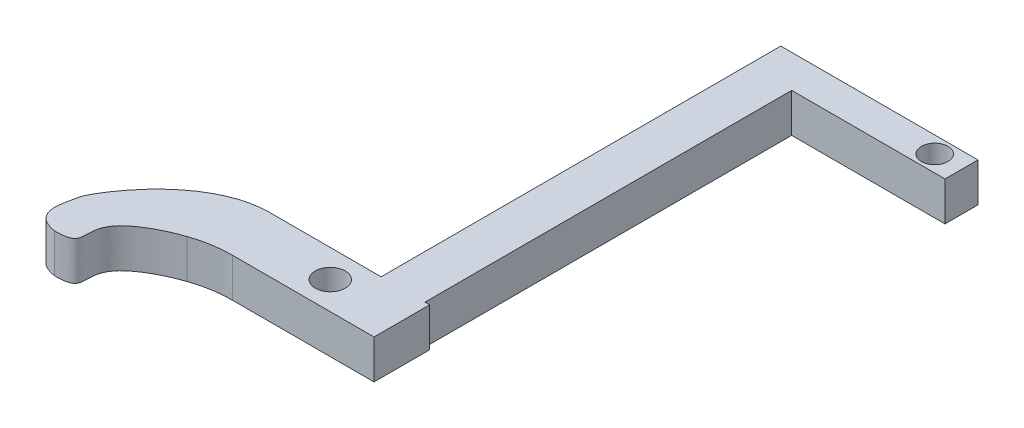
ISO-10303-21;
HEADER;
FILE_DESCRIPTION(('STEP AP214'),'2;1');
FILE_NAME('part.step','',(''),(''),'','','');
FILE_SCHEMA(('AUTOMOTIVE_DESIGN { 1 0 10303 214 1 1 1 1 }'));
ENDSEC;
DATA;
#1=APPLICATION_CONTEXT('core data for automotive mechanical design processes');
#2=APPLICATION_PROTOCOL_DEFINITION('international standard','automotive_design',2000,#1);
#3=PRODUCT_CONTEXT('',#1,'mechanical');
#4=PRODUCT('Part','Part','',(#3));
#5=PRODUCT_RELATED_PRODUCT_CATEGORY('part','',(#4));
#6=PRODUCT_DEFINITION_FORMATION('','',#4);
#7=PRODUCT_DEFINITION_CONTEXT('part definition',#1,'design');
#8=PRODUCT_DEFINITION('design','',#6,#7);
#9=PRODUCT_DEFINITION_SHAPE('','',#8);
#10=(LENGTH_UNIT() NAMED_UNIT(*) SI_UNIT(.MILLI.,.METRE.));
#11=(NAMED_UNIT(*) PLANE_ANGLE_UNIT() SI_UNIT($,.RADIAN.));
#12=(NAMED_UNIT(*) SI_UNIT($,.STERADIAN.) SOLID_ANGLE_UNIT());
#13=UNCERTAINTY_MEASURE_WITH_UNIT(LENGTH_MEASURE(1.E-05),#10,'distance_accuracy_value','');
#14=(GEOMETRIC_REPRESENTATION_CONTEXT(3) GLOBAL_UNCERTAINTY_ASSIGNED_CONTEXT((#13)) GLOBAL_UNIT_ASSIGNED_CONTEXT((#10,
#11,#12)) REPRESENTATION_CONTEXT('',''));
#15=CARTESIAN_POINT('',(0.,0.,0.));
#16=DIRECTION('',(0.,0.,1.));
#17=DIRECTION('',(1.,0.,0.));
#18=AXIS2_PLACEMENT_3D('',#15,#16,#17);
#19=CARTESIAN_POINT('',(9.39471263885483,3.9,-13.3426777583693));
#20=CARTESIAN_POINT('',(6.79427073100031,3.9,-13.7760847430118));
#21=CARTESIAN_POINT('',(7.42371497519791,3.9,-16.0946088556389));
#22=CARTESIAN_POINT('',(7.96105575206158,3.9,-18.6181851229023));
#23=CARTESIAN_POINT('',(13.166799439437,3.9,-25.974660634704));
#24=CARTESIAN_POINT('',(19.1234364955157,3.9,-25.7010819216978));
#25=B_SPLINE_CURVE_WITH_KNOTS('',3,(#19,#20,#21,#22,#23,#24),.UNSPECIFIED.,.F.,.F.,(4,1,1,4),
(0.,0.580649742311301,0.680649742311301,1.),.UNSPECIFIED.);
#26=DIRECTION('',(0.,-1.,0.));
#27=VECTOR('',#26,1.);
#28=SURFACE_OF_LINEAR_EXTRUSION('',#25,#27);
#29=CARTESIAN_POINT('',(9.39471263885482,3.9,-13.3426777583693));
#30=VERTEX_POINT('',#29);
#31=CARTESIAN_POINT('',(18.9793949508873,3.9,-25.7065689780499));
#32=VERTEX_POINT('',#31);
#33=EDGE_CURVE('E180',#30,#32,#25,.T.);
#34=ORIENTED_EDGE('',*,*,#33,.T.);
#35=DIRECTION('',(0.,-1.,0.));
#36=VECTOR('',#35,1.);
#37=CARTESIAN_POINT('',(18.9793949508873,3.9,-25.7065689780499));
#38=LINE('',#37,#36);
#39=CARTESIAN_POINT('',(18.9793949508873,0.,-25.7065689780499));
#40=VERTEX_POINT('',#39);
#41=EDGE_CURVE('E225',#32,#40,#38,.T.);
#42=ORIENTED_EDGE('',*,*,#41,.T.);
#43=CARTESIAN_POINT('',(9.39471263885483,0.,-13.3426777583693));
#44=CARTESIAN_POINT('',(6.79427073100031,0.,-13.7760847430118));
#45=CARTESIAN_POINT('',(7.42371497519791,0.,-16.0946088556389));
#46=CARTESIAN_POINT('',(7.96105575206158,0.,-18.6181851229023));
#47=CARTESIAN_POINT('',(13.166799439437,0.,-25.974660634704));
#48=CARTESIAN_POINT('',(19.1234364955157,0.,-25.7010819216978));
#49=B_SPLINE_CURVE_WITH_KNOTS('',3,(#43,#44,#45,#46,#47,#48),.UNSPECIFIED.,.F.,.F.,(4,1,1,4),
(0.,0.580649742311301,0.680649742311301,1.),.UNSPECIFIED.);
#50=CARTESIAN_POINT('',(9.39471263885482,0.,-13.3426777583693));
#51=VERTEX_POINT('',#50);
#52=EDGE_CURVE('E295',#51,#40,#49,.T.);
#53=ORIENTED_EDGE('',*,*,#52,.F.);
#54=DIRECTION('',(0.,-1.,0.));
#55=VECTOR('',#54,1.);
#56=CARTESIAN_POINT('',(9.39471263885482,3.9,-13.3426777583693));
#57=LINE('',#56,#55);
#58=EDGE_CURVE('E246',#30,#51,#57,.T.);
#59=ORIENTED_EDGE('',*,*,#58,.F.);
#60=EDGE_LOOP('',(#34,#42,#53,#59));
#61=FACE_BOUND('',#60,.T.);
#62=ADVANCED_FACE('F41',(#61),#28,.T.);
#63=CARTESIAN_POINT('',(19.1234364955155,3.9,-20.1323581347365));
#64=CARTESIAN_POINT('',(16.2160059305895,3.9,-19.6758710564032));
#65=CARTESIAN_POINT('',(8.71776321899043,3.9,-15.9481805674973));
#66=CARTESIAN_POINT('',(12.7758220810839,3.9,-13.309851453105));
#67=CARTESIAN_POINT('',(9.39471263885482,3.9,-13.3426777583693));
#68=B_SPLINE_CURVE_WITH_KNOTS('',3,(#63,#64,#65,#66,#67),.UNSPECIFIED.,.F.,.F.,(4,1,4),(0.,
0.368689926471484,1.),.UNSPECIFIED.);
#69=DIRECTION('',(0.,-1.,0.));
#70=VECTOR('',#69,1.);
#71=SURFACE_OF_LINEAR_EXTRUSION('',#68,#70);
#72=CARTESIAN_POINT('',(19.1234364955155,0.,-20.1323581347365));
#73=CARTESIAN_POINT('',(16.2160059305895,0.,-19.6758710564032));
#74=CARTESIAN_POINT('',(8.71776321899043,0.,-15.9481805674973));
#75=CARTESIAN_POINT('',(12.7758220810839,0.,-13.309851453105));
#76=CARTESIAN_POINT('',(9.39471263885482,0.,-13.3426777583693));
#77=B_SPLINE_CURVE_WITH_KNOTS('',3,(#72,#73,#74,#75,#76),.UNSPECIFIED.,.F.,.F.,(4,1,4),(0.,
0.368689926471484,1.),.UNSPECIFIED.);
#78=CARTESIAN_POINT('',(16.5474678199235,0.,-19.4901026125291));
#79=VERTEX_POINT('',#78);
#80=EDGE_CURVE('E290',#79,#51,#77,.T.);
#81=ORIENTED_EDGE('',*,*,#80,.F.);
#82=DIRECTION('',(0.,-1.,0.));
#83=VECTOR('',#82,1.);
#84=CARTESIAN_POINT('',(16.5474678199235,0.,-19.4901026125291));
#85=LINE('',#84,#83);
#86=CARTESIAN_POINT('',(16.5474678199235,3.9,-19.4901026125291));
#87=VERTEX_POINT('',#86);
#88=EDGE_CURVE('E233',#79,#87,#85,.F.);
#89=ORIENTED_EDGE('',*,*,#88,.T.);
#90=EDGE_CURVE('E188',#87,#30,#68,.T.);
#91=ORIENTED_EDGE('',*,*,#90,.T.);
#92=ORIENTED_EDGE('',*,*,#58,.T.);
#93=EDGE_LOOP('',(#81,#89,#91,#92));
#94=FACE_BOUND('',#93,.T.);
#95=ADVANCED_FACE('F200',(#94),#71,.T.);
#96=CARTESIAN_POINT('',(0.,3.9,-20.1323581347365));
#97=DIRECTION('',(0.,0.,-1.));
#98=DIRECTION('',(-1.,0.,0.));
#99=AXIS2_PLACEMENT_3D('',#96,#97,#98);
#100=PLANE('',#99);
#101=DIRECTION('',(1.,0.,0.));
#102=VECTOR('',#101,1.);
#103=CARTESIAN_POINT('',(0.,3.9,-20.1323581347365));
#104=LINE('',#103,#102);
#105=CARTESIAN_POINT('',(20.4206629321236,3.9,-20.1323581347365));
#106=VERTEX_POINT('',#105);
#107=CARTESIAN_POINT('',(34.5975482501285,3.9,-20.1323581347365));
#108=VERTEX_POINT('',#107);
#109=EDGE_CURVE('E327',#106,#108,#104,.T.);
#110=ORIENTED_EDGE('',*,*,#109,.F.);
#111=DIRECTION('',(0.,-1.,0.));
#112=VECTOR('',#111,1.);
#113=CARTESIAN_POINT('',(20.4206629321236,3.9,-20.1323581347365));
#114=LINE('',#113,#112);
#115=CARTESIAN_POINT('',(20.4206629321236,0.,-20.1323581347365));
#116=VERTEX_POINT('',#115);
#117=EDGE_CURVE('E238',#106,#116,#114,.T.);
#118=ORIENTED_EDGE('',*,*,#117,.T.);
#119=DIRECTION('',(1.,0.,0.));
#120=VECTOR('',#119,1.);
#121=CARTESIAN_POINT('',(0.,0.,-20.1323581347365));
#122=LINE('',#121,#120);
#123=CARTESIAN_POINT('',(34.5975482501285,0.,-20.1323581347365));
#124=VERTEX_POINT('',#123);
#125=EDGE_CURVE('E287',#116,#124,#122,.T.);
#126=ORIENTED_EDGE('',*,*,#125,.T.);
#127=DIRECTION('',(0.,-1.,0.));
#128=VECTOR('',#127,1.);
#129=CARTESIAN_POINT('',(34.5975482501285,3.9,-20.1323581347365));
#130=LINE('',#129,#128);
#131=EDGE_CURVE('E250',#108,#124,#130,.T.);
#132=ORIENTED_EDGE('',*,*,#131,.F.);
#133=EDGE_LOOP('',(#110,#118,#126,#132));
#134=FACE_BOUND('',#133,.T.);
#135=ADVANCED_FACE('F346',(#134),#100,.F.);
#136=CARTESIAN_POINT('',(34.5975482501285,3.9,0.));
#137=DIRECTION('',(1.,0.,0.));
#138=DIRECTION('',(0.,0.,-1.));
#139=AXIS2_PLACEMENT_3D('',#136,#137,#138);
#140=PLANE('',#139);
#141=DIRECTION('',(0.,0.,1.));
#142=VECTOR('',#141,1.);
#143=CARTESIAN_POINT('',(34.5975482501285,0.,0.));
#144=LINE('',#143,#142);
#145=CARTESIAN_POINT('',(34.5975482501285,0.,-25.7010819216979));
#146=VERTEX_POINT('',#145);
#147=EDGE_CURVE('E283',#146,#124,#144,.T.);
#148=ORIENTED_EDGE('',*,*,#147,.F.);
#149=DIRECTION('',(0.,-1.,0.));
#150=VECTOR('',#149,1.);
#151=CARTESIAN_POINT('',(34.5975482501285,3.9,-25.7010819216979));
#152=LINE('',#151,#150);
#153=CARTESIAN_POINT('',(34.5975482501285,3.9,-25.7010819216979));
#154=VERTEX_POINT('',#153);
#155=EDGE_CURVE('E254',#154,#146,#152,.T.);
#156=ORIENTED_EDGE('',*,*,#155,.F.);
#157=DIRECTION('',(0.,0.,1.));
#158=VECTOR('',#157,1.);
#159=CARTESIAN_POINT('',(34.5975482501285,3.9,0.));
#160=LINE('',#159,#158);
#161=EDGE_CURVE('E324',#154,#108,#160,.T.);
#162=ORIENTED_EDGE('',*,*,#161,.T.);
#163=ORIENTED_EDGE('',*,*,#131,.T.);
#164=EDGE_LOOP('',(#148,#156,#162,#163));
#165=FACE_BOUND('',#164,.T.);
#166=ADVANCED_FACE('F349',(#165),#140,.T.);
#167=CARTESIAN_POINT('',(0.,3.9,-25.7010819216979));
#168=DIRECTION('',(0.,0.,-1.));
#169=DIRECTION('',(-1.,0.,0.));
#170=AXIS2_PLACEMENT_3D('',#167,#168,#169);
#171=PLANE('',#170);
#172=DIRECTION('',(1.,0.,0.));
#173=VECTOR('',#172,1.);
#174=CARTESIAN_POINT('',(0.,0.,-25.7010819216979));
#175=LINE('',#174,#173);
#176=CARTESIAN_POINT('',(34.1286495483883,0.,-25.7010819216979));
#177=VERTEX_POINT('',#176);
#178=EDGE_CURVE('E279',#177,#146,#175,.T.);
#179=ORIENTED_EDGE('',*,*,#178,.F.);
#180=DIRECTION('',(0.,-1.,0.));
#181=VECTOR('',#180,1.);
#182=CARTESIAN_POINT('',(34.1286495483883,3.9,-25.7010819216979));
#183=LINE('',#182,#181);
#184=CARTESIAN_POINT('',(34.1286495483883,3.9,-25.7010819216979));
#185=VERTEX_POINT('',#184);
#186=EDGE_CURVE('E257',#185,#177,#183,.T.);
#187=ORIENTED_EDGE('',*,*,#186,.F.);
#188=DIRECTION('',(1.,0.,0.));
#189=VECTOR('',#188,1.);
#190=CARTESIAN_POINT('',(0.,3.9,-25.7010819216979));
#191=LINE('',#190,#189);
#192=EDGE_CURVE('E320',#185,#154,#191,.T.);
#193=ORIENTED_EDGE('',*,*,#192,.T.);
#194=ORIENTED_EDGE('',*,*,#155,.T.);
#195=EDGE_LOOP('',(#179,#187,#193,#194));
#196=FACE_BOUND('',#195,.T.);
#197=ADVANCED_FACE('F352',(#196),#171,.T.);
#198=CARTESIAN_POINT('',(34.1286495483883,3.9,0.));
#199=DIRECTION('',(-1.,0.,0.));
#200=DIRECTION('',(0.,0.,1.));
#201=AXIS2_PLACEMENT_3D('',#198,#199,#200);
#202=PLANE('',#201);
#203=DIRECTION('',(0.,0.,-1.));
#204=VECTOR('',#203,1.);
#205=CARTESIAN_POINT('',(34.1286495483883,0.,0.));
#206=LINE('',#205,#204);
#207=CARTESIAN_POINT('',(34.1286495483883,0.,-62.4007581844849));
#208=VERTEX_POINT('',#207);
#209=EDGE_CURVE('E62',#177,#208,#206,.T.);
#210=ORIENTED_EDGE('',*,*,#209,.T.);
#211=DIRECTION('',(0.,1.,0.));
#212=VECTOR('',#211,1.);
#213=CARTESIAN_POINT('',(34.1286495483883,3.9,-62.4007581844849));
#214=LINE('',#213,#212);
#215=CARTESIAN_POINT('',(34.1286495483883,3.9,-62.4007581844849));
#216=VERTEX_POINT('',#215);
#217=EDGE_CURVE('E57',#208,#216,#214,.T.);
#218=ORIENTED_EDGE('',*,*,#217,.T.);
#219=DIRECTION('',(0.,0.,-1.));
#220=VECTOR('',#219,1.);
#221=CARTESIAN_POINT('',(34.1286495483883,3.9,0.));
#222=LINE('',#221,#220);
#223=EDGE_CURVE('E143',#185,#216,#222,.T.);
#224=ORIENTED_EDGE('',*,*,#223,.F.);
#225=ORIENTED_EDGE('',*,*,#186,.T.);
#226=EDGE_LOOP('',(#210,#218,#224,#225));
#227=FACE_BOUND('',#226,.T.);
#228=ADVANCED_FACE('F353',(#227),#202,.F.);
#229=CARTESIAN_POINT('',(0.,3.9,-65.7010819216978));
#230=DIRECTION('',(0.,0.,-1.));
#231=DIRECTION('',(-1.,0.,0.));
#232=AXIS2_PLACEMENT_3D('',#229,#230,#231);
#233=PLANE('',#232);
#234=DIRECTION('',(1.,0.,0.));
#235=VECTOR('',#234,1.);
#236=CARTESIAN_POINT('',(0.,0.,-65.7010819216978));
#237=LINE('',#236,#235);
#238=CARTESIAN_POINT('',(29.7384941087649,0.,-65.7010819216978));
#239=VERTEX_POINT('',#238);
#240=CARTESIAN_POINT('',(49.4757030607427,0.,-65.7010819216978));
#241=VERTEX_POINT('',#240);
#242=EDGE_CURVE('E274',#239,#241,#237,.T.);
#243=ORIENTED_EDGE('',*,*,#242,.F.);
#244=DIRECTION('',(0.,-1.,0.));
#245=VECTOR('',#244,1.);
#246=CARTESIAN_POINT('',(29.7384941087649,3.9,-65.7010819216978));
#247=LINE('',#246,#245);
#248=CARTESIAN_POINT('',(29.7384941087649,3.9,-65.7010819216978));
#249=VERTEX_POINT('',#248);
#250=EDGE_CURVE('E260',#249,#239,#247,.T.);
#251=ORIENTED_EDGE('',*,*,#250,.F.);
#252=DIRECTION('',(1.,0.,0.));
#253=VECTOR('',#252,1.);
#254=CARTESIAN_POINT('',(0.,3.9,-65.7010819216978));
#255=LINE('',#254,#253);
#256=CARTESIAN_POINT('',(49.4757030607427,3.9,-65.7010819216978));
#257=VERTEX_POINT('',#256);
#258=EDGE_CURVE('E315',#249,#257,#255,.T.);
#259=ORIENTED_EDGE('',*,*,#258,.T.);
#260=DIRECTION('',(0.,1.,0.));
#261=VECTOR('',#260,1.);
#262=CARTESIAN_POINT('',(49.4757030607427,-20.0112356935909,-65.7010819216978));
#263=LINE('',#262,#261);
#264=EDGE_CURVE('E157',#241,#257,#263,.T.);
#265=ORIENTED_EDGE('',*,*,#264,.F.);
#266=EDGE_LOOP('',(#243,#251,#259,#265));
#267=FACE_BOUND('',#266,.T.);
#268=ADVANCED_FACE('F355',(#267),#233,.T.);
#269=CARTESIAN_POINT('',(29.7384941087649,3.9,0.));
#270=DIRECTION('',(-1.,0.,0.));
#271=DIRECTION('',(0.,0.,1.));
#272=AXIS2_PLACEMENT_3D('',#269,#270,#271);
#273=PLANE('',#272);
#274=DIRECTION('',(0.,0.,-1.));
#275=VECTOR('',#274,1.);
#276=CARTESIAN_POINT('',(29.7384941087649,3.9,0.));
#277=LINE('',#276,#275);
#278=CARTESIAN_POINT('',(29.7384941087649,3.9,-25.7010819216979));
#279=VERTEX_POINT('',#278);
#280=EDGE_CURVE('E312',#279,#249,#277,.T.);
#281=ORIENTED_EDGE('',*,*,#280,.T.);
#282=ORIENTED_EDGE('',*,*,#250,.T.);
#283=DIRECTION('',(0.,0.,-1.));
#284=VECTOR('',#283,1.);
#285=CARTESIAN_POINT('',(29.7384941087649,0.,0.));
#286=LINE('',#285,#284);
#287=CARTESIAN_POINT('',(29.7384941087649,0.,-25.7010819216979));
#288=VERTEX_POINT('',#287);
#289=EDGE_CURVE('E271',#288,#239,#286,.T.);
#290=ORIENTED_EDGE('',*,*,#289,.F.);
#291=DIRECTION('',(0.,-1.,0.));
#292=VECTOR('',#291,1.);
#293=CARTESIAN_POINT('',(29.7384941087649,3.9,-25.7010819216979));
#294=LINE('',#293,#292);
#295=EDGE_CURVE('E264',#279,#288,#294,.T.);
#296=ORIENTED_EDGE('',*,*,#295,.F.);
#297=EDGE_LOOP('',(#281,#282,#290,#296));
#298=FACE_BOUND('',#297,.T.);
#299=ADVANCED_FACE('F206',(#298),#273,.T.);
#300=CARTESIAN_POINT('',(27.4343966390578,3.9,-22.9167200282172));
#301=DIRECTION('',(0.,-1.,0.));
#302=DIRECTION('',(0.,0.,-1.));
#303=AXIS2_PLACEMENT_3D('',#300,#301,#302);
#304=CYLINDRICAL_SURFACE('',#303,1.5);
#305=CARTESIAN_POINT('',(27.4343966390578,3.9,-22.9167200282172));
#306=DIRECTION('',(0.,1.,0.));
#307=DIRECTION('',(0.,0.,1.));
#308=AXIS2_PLACEMENT_3D('',#305,#306,#307);
#309=CIRCLE('',#308,1.5);
#310=CARTESIAN_POINT('',(27.4343966390578,3.9,-21.4167200282172));
#311=VERTEX_POINT('',#310);
#312=EDGE_CURVE('E176',#311,#311,#309,.T.);
#313=ORIENTED_EDGE('',*,*,#312,.T.);
#314=EDGE_LOOP('',(#313));
#315=FACE_BOUND('',#314,.T.);
#316=CARTESIAN_POINT('',(27.4343966390578,0.,-22.9167200282172));
#317=DIRECTION('',(0.,1.,0.));
#318=DIRECTION('',(0.,0.,1.));
#319=AXIS2_PLACEMENT_3D('',#316,#317,#318);
#320=CIRCLE('',#319,1.5);
#321=CARTESIAN_POINT('',(27.4343966390578,0.,-21.4167200282172));
#322=VERTEX_POINT('',#321);
#323=EDGE_CURVE('E175',#322,#322,#320,.T.);
#324=ORIENTED_EDGE('',*,*,#323,.F.);
#325=EDGE_LOOP('',(#324));
#326=FACE_BOUND('',#325,.T.);
#327=ADVANCED_FACE('F203',(#315,#326),#304,.F.);
#328=CARTESIAN_POINT('',(0.,3.9,-25.7010819216979));
#329=DIRECTION('',(0.,0.,-1.));
#330=DIRECTION('',(-1.,0.,0.));
#331=AXIS2_PLACEMENT_3D('',#328,#329,#330);
#332=PLANE('',#331);
#333=DIRECTION('',(1.,0.,0.));
#334=VECTOR('',#333,1.);
#335=CARTESIAN_POINT('',(0.,0.,-25.7010819216979));
#336=LINE('',#335,#334);
#337=CARTESIAN_POINT('',(19.342243741242,0.,-25.7010819216979));
#338=VERTEX_POINT('',#337);
#339=EDGE_CURVE('E181',#338,#288,#336,.T.);
#340=ORIENTED_EDGE('',*,*,#339,.F.);
#341=DIRECTION('',(0.,1.,0.));
#342=VECTOR('',#341,1.);
#343=CARTESIAN_POINT('',(19.342243741242,3.9,-25.7010819216979));
#344=LINE('',#343,#342);
#345=CARTESIAN_POINT('',(19.342243741242,3.9,-25.7010819216979));
#346=VERTEX_POINT('',#345);
#347=EDGE_CURVE('E223',#338,#346,#344,.T.);
#348=ORIENTED_EDGE('',*,*,#347,.T.);
#349=DIRECTION('',(1.,0.,0.));
#350=VECTOR('',#349,1.);
#351=CARTESIAN_POINT('',(0.,3.9,-25.7010819216979));
#352=LINE('',#351,#350);
#353=EDGE_CURVE('E268',#346,#279,#352,.T.);
#354=ORIENTED_EDGE('',*,*,#353,.T.);
#355=ORIENTED_EDGE('',*,*,#295,.T.);
#356=EDGE_LOOP('',(#340,#348,#354,#355));
#357=FACE_BOUND('',#356,.T.);
#358=ADVANCED_FACE('F205',(#357),#332,.T.);
#359=CARTESIAN_POINT('',(0.,3.9,0.));
#360=DIRECTION('',(0.,1.,0.));
#361=DIRECTION('',(0.,0.,1.));
#362=AXIS2_PLACEMENT_3D('',#359,#360,#361);
#363=PLANE('',#362);
#364=ORIENTED_EDGE('',*,*,#223,.T.);
#365=DIRECTION('',(1.,0.,0.));
#366=VECTOR('',#365,1.);
#367=CARTESIAN_POINT('',(29.7384941087649,3.9,-62.4007581844849));
#368=LINE('',#367,#366);
#369=CARTESIAN_POINT('',(49.4757030607427,3.9,-62.4007581844849));
#370=VERTEX_POINT('',#369);
#371=EDGE_CURVE('E135',#216,#370,#368,.T.);
#372=ORIENTED_EDGE('',*,*,#371,.T.);
#373=DIRECTION('',(0.,0.,-1.));
#374=VECTOR('',#373,1.);
#375=CARTESIAN_POINT('',(49.4757030607427,3.9,-65.7010819216978));
#376=LINE('',#375,#374);
#377=EDGE_CURVE('E141',#370,#257,#376,.T.);
#378=ORIENTED_EDGE('',*,*,#377,.T.);
#379=ORIENTED_EDGE('',*,*,#258,.F.);
#380=ORIENTED_EDGE('',*,*,#280,.F.);
#381=ORIENTED_EDGE('',*,*,#353,.F.);
#382=CARTESIAN_POINT('',(19.342243741242,3.9,-37.7010819216978));
#383=DIRECTION('',(0.,1.,0.));
#384=DIRECTION('',(0.,0.,1.));
#385=AXIS2_PLACEMENT_3D('',#382,#383,#384);
#386=CIRCLE('',#385,12.);
#387=EDGE_CURVE('E222',#346,#32,#386,.F.);
#388=ORIENTED_EDGE('',*,*,#387,.T.);
#389=ORIENTED_EDGE('',*,*,#33,.F.);
#390=ORIENTED_EDGE('',*,*,#90,.F.);
#391=CARTESIAN_POINT('',(20.4206629321236,3.9,-8.13235813473648));
#392=DIRECTION('',(0.,1.,0.));
#393=DIRECTION('',(0.,0.,1.));
#394=AXIS2_PLACEMENT_3D('',#391,#392,#393);
#395=CIRCLE('',#394,12.);
#396=EDGE_CURVE('E11',#87,#106,#395,.F.);
#397=ORIENTED_EDGE('',*,*,#396,.T.);
#398=ORIENTED_EDGE('',*,*,#109,.T.);
#399=ORIENTED_EDGE('',*,*,#161,.F.);
#400=ORIENTED_EDGE('',*,*,#192,.F.);
#401=EDGE_LOOP('',(#364,#372,#378,#379,#380,#381,#388,#389,#390,#397,#398,#399,#400));
#402=FACE_BOUND('',#401,.T.);
#403=ORIENTED_EDGE('',*,*,#312,.F.);
#404=EDGE_LOOP('',(#403));
#405=FACE_BOUND('',#404,.T.);
#406=CARTESIAN_POINT('',(46.7913972407427,3.9,-64.0509200530914));
#407=DIRECTION('',(0.,1.,0.));
#408=DIRECTION('',(0.,0.,1.));
#409=AXIS2_PLACEMENT_3D('',#406,#407,#408);
#410=CIRCLE('',#409,1.32539338335448);
#411=CARTESIAN_POINT('',(46.7913972407427,3.9,-62.7255266697369));
#412=VERTEX_POINT('',#411);
#413=EDGE_CURVE('E146',#412,#412,#410,.T.);
#414=ORIENTED_EDGE('',*,*,#413,.F.);
#415=EDGE_LOOP('',(#414));
#416=FACE_BOUND('',#415,.T.);
#417=ADVANCED_FACE('F137',(#402,#405,#416),#363,.T.);
#418=CARTESIAN_POINT('',(0.,0.,0.));
#419=DIRECTION('',(0.,1.,0.));
#420=DIRECTION('',(0.,0.,1.));
#421=AXIS2_PLACEMENT_3D('',#418,#419,#420);
#422=PLANE('',#421);
#423=ORIENTED_EDGE('',*,*,#323,.T.);
#424=EDGE_LOOP('',(#423));
#425=FACE_BOUND('',#424,.T.);
#426=ORIENTED_EDGE('',*,*,#289,.T.);
#427=ORIENTED_EDGE('',*,*,#242,.T.);
#428=DIRECTION('',(0.,0.,1.));
#429=VECTOR('',#428,1.);
#430=CARTESIAN_POINT('',(49.4757030607427,0.,-65.7010819216978));
#431=LINE('',#430,#429);
#432=CARTESIAN_POINT('',(49.4757030607427,0.,-62.4007581844849));
#433=VERTEX_POINT('',#432);
#434=EDGE_CURVE('E167',#241,#433,#431,.T.);
#435=ORIENTED_EDGE('',*,*,#434,.T.);
#436=DIRECTION('',(-1.,0.,0.));
#437=VECTOR('',#436,1.);
#438=CARTESIAN_POINT('',(29.7384941087649,0.,-62.4007581844849));
#439=LINE('',#438,#437);
#440=EDGE_CURVE('E153',#433,#208,#439,.T.);
#441=ORIENTED_EDGE('',*,*,#440,.T.);
#442=ORIENTED_EDGE('',*,*,#209,.F.);
#443=ORIENTED_EDGE('',*,*,#178,.T.);
#444=ORIENTED_EDGE('',*,*,#147,.T.);
#445=ORIENTED_EDGE('',*,*,#125,.F.);
#446=CARTESIAN_POINT('',(20.4206629321236,0.,-8.13235813473648));
#447=DIRECTION('',(0.,1.,0.));
#448=DIRECTION('',(0.,0.,1.));
#449=AXIS2_PLACEMENT_3D('',#446,#447,#448);
#450=CIRCLE('',#449,12.);
#451=EDGE_CURVE('E50',#116,#79,#450,.T.);
#452=ORIENTED_EDGE('',*,*,#451,.T.);
#453=ORIENTED_EDGE('',*,*,#80,.T.);
#454=ORIENTED_EDGE('',*,*,#52,.T.);
#455=CARTESIAN_POINT('',(19.342243741242,0.,-37.7010819216978));
#456=DIRECTION('',(0.,1.,0.));
#457=DIRECTION('',(0.,0.,1.));
#458=AXIS2_PLACEMENT_3D('',#455,#456,#457);
#459=CIRCLE('',#458,12.);
#460=EDGE_CURVE('E229',#40,#338,#459,.T.);
#461=ORIENTED_EDGE('',*,*,#460,.T.);
#462=ORIENTED_EDGE('',*,*,#339,.T.);
#463=EDGE_LOOP('',(#426,#427,#435,#441,#442,#443,#444,#445,#452,#453,#454,#461,#462));
#464=FACE_BOUND('',#463,.T.);
#465=CARTESIAN_POINT('',(46.7913972407427,0.,-64.0509200530914));
#466=DIRECTION('',(0.,1.,0.));
#467=DIRECTION('',(0.,0.,1.));
#468=AXIS2_PLACEMENT_3D('',#465,#466,#467);
#469=CIRCLE('',#468,1.32539338335448);
#470=CARTESIAN_POINT('',(46.7913972407427,0.,-62.7255266697369));
#471=VERTEX_POINT('',#470);
#472=EDGE_CURVE('E169',#471,#471,#469,.F.);
#473=ORIENTED_EDGE('',*,*,#472,.F.);
#474=EDGE_LOOP('',(#473));
#475=FACE_BOUND('',#474,.T.);
#476=ADVANCED_FACE('F210',(#425,#464,#475),#422,.F.);
#477=CARTESIAN_POINT('',(19.342243741242,1.95,-37.7010819216978));
#478=DIRECTION('',(0.,-1.,0.));
#479=DIRECTION('',(0.,0.,-1.));
#480=AXIS2_PLACEMENT_3D('',#477,#478,#479);
#481=CYLINDRICAL_SURFACE('',#480,12.);
#482=ORIENTED_EDGE('',*,*,#387,.F.);
#483=ORIENTED_EDGE('',*,*,#347,.F.);
#484=ORIENTED_EDGE('',*,*,#460,.F.);
#485=ORIENTED_EDGE('',*,*,#41,.F.);
#486=EDGE_LOOP('',(#482,#483,#484,#485));
#487=FACE_BOUND('',#486,.T.);
#488=ADVANCED_FACE('F208',(#487),#481,.F.);
#489=CARTESIAN_POINT('',(20.4206629321236,1.95,-8.13235813473648));
#490=DIRECTION('',(0.,-1.,0.));
#491=DIRECTION('',(0.,0.,-1.));
#492=AXIS2_PLACEMENT_3D('',#489,#490,#491);
#493=CYLINDRICAL_SURFACE('',#492,12.);
#494=ORIENTED_EDGE('',*,*,#396,.F.);
#495=ORIENTED_EDGE('',*,*,#88,.F.);
#496=ORIENTED_EDGE('',*,*,#451,.F.);
#497=ORIENTED_EDGE('',*,*,#117,.F.);
#498=EDGE_LOOP('',(#494,#495,#496,#497));
#499=FACE_BOUND('',#498,.T.);
#500=ADVANCED_FACE('F43',(#499),#493,.F.);
#501=CARTESIAN_POINT('',(29.7384941087649,-20.0112356935909,-62.4007581844849));
#502=DIRECTION('',(0.,0.,1.));
#503=DIRECTION('',(1.,0.,0.));
#504=AXIS2_PLACEMENT_3D('',#501,#502,#503);
#505=PLANE('',#504);
#506=ORIENTED_EDGE('',*,*,#217,.F.);
#507=ORIENTED_EDGE('',*,*,#440,.F.);
#508=DIRECTION('',(0.,1.,0.));
#509=VECTOR('',#508,1.);
#510=CARTESIAN_POINT('',(49.4757030607427,-20.0112356935909,-62.4007581844849));
#511=LINE('',#510,#509);
#512=EDGE_CURVE('E150',#433,#370,#511,.T.);
#513=ORIENTED_EDGE('',*,*,#512,.T.);
#514=ORIENTED_EDGE('',*,*,#371,.F.);
#515=EDGE_LOOP('',(#506,#507,#513,#514));
#516=FACE_BOUND('',#515,.T.);
#517=ADVANCED_FACE('F151',(#516),#505,.T.);
#518=CARTESIAN_POINT('',(49.4757030607427,-20.0112356935909,-65.7010819216978));
#519=DIRECTION('',(1.,0.,0.));
#520=DIRECTION('',(0.,0.,-1.));
#521=AXIS2_PLACEMENT_3D('',#518,#519,#520);
#522=PLANE('',#521);
#523=ORIENTED_EDGE('',*,*,#434,.F.);
#524=ORIENTED_EDGE('',*,*,#264,.T.);
#525=ORIENTED_EDGE('',*,*,#377,.F.);
#526=ORIENTED_EDGE('',*,*,#512,.F.);
#527=EDGE_LOOP('',(#523,#524,#525,#526));
#528=FACE_BOUND('',#527,.T.);
#529=ADVANCED_FACE('F160',(#528),#522,.T.);
#530=CARTESIAN_POINT('',(46.7913972407427,-20.0112356935909,-64.0509200530914));
#531=DIRECTION('',(0.,1.,0.));
#532=DIRECTION('',(0.,0.,1.));
#533=AXIS2_PLACEMENT_3D('',#530,#531,#532);
#534=CYLINDRICAL_SURFACE('',#533,1.32539338335448);
#535=ORIENTED_EDGE('',*,*,#472,.T.);
#536=EDGE_LOOP('',(#535));
#537=FACE_BOUND('',#536,.T.);
#538=ORIENTED_EDGE('',*,*,#413,.T.);
#539=EDGE_LOOP('',(#538));
#540=FACE_BOUND('',#539,.T.);
#541=ADVANCED_FACE('F477',(#537,#540),#534,.F.);
#542=CLOSED_SHELL('',(#62,#95,#135,#166,#197,#228,#268,#299,#327,#358,#417,#476,#488,#500,#517,
#529,#541));
#543=MANIFOLD_SOLID_BREP('B2',#542);
#544=ADVANCED_BREP_SHAPE_REPRESENTATION('',(#18,#543),#14);
#545=SHAPE_DEFINITION_REPRESENTATION(#9,#544);
ENDSEC;
END-ISO-10303-21;
